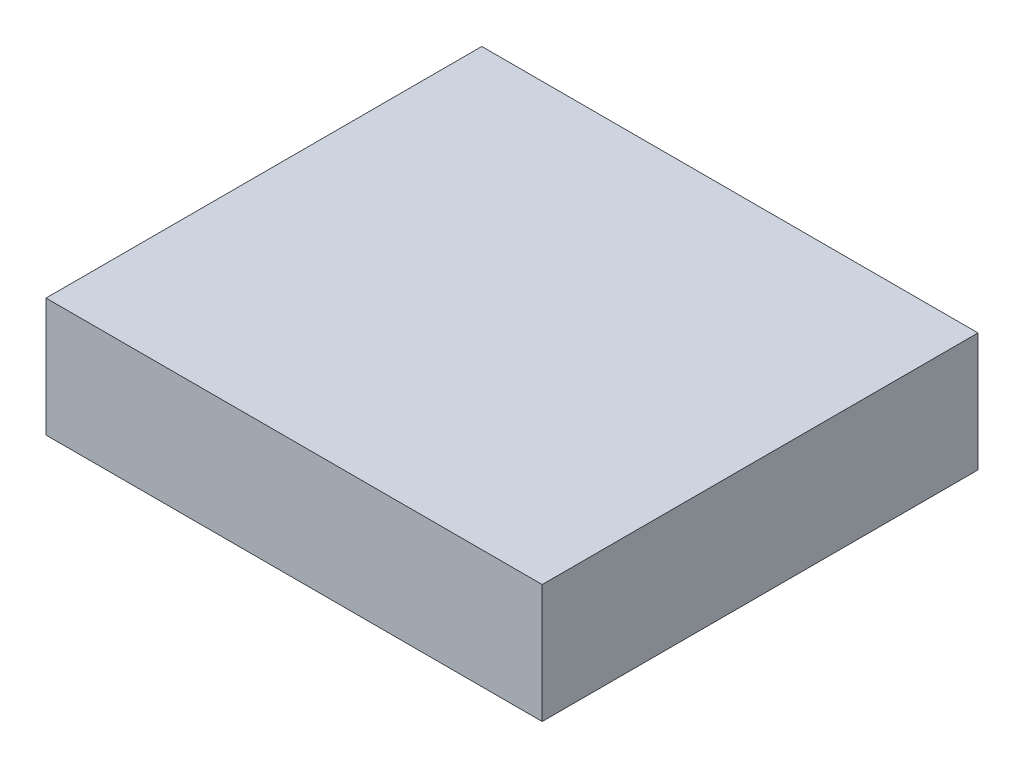
ISO-10303-21;
HEADER;
FILE_DESCRIPTION(('STEP AP214'),'2;1');
FILE_NAME('part.step','',(''),(''),'','','');
FILE_SCHEMA(('AUTOMOTIVE_DESIGN { 1 0 10303 214 1 1 1 1 }'));
ENDSEC;
DATA;
#1=APPLICATION_CONTEXT('core data for automotive mechanical design processes');
#2=APPLICATION_PROTOCOL_DEFINITION('international standard','automotive_design',2000,#1);
#3=PRODUCT_CONTEXT('',#1,'mechanical');
#4=PRODUCT('Part','Part','',(#3));
#5=PRODUCT_RELATED_PRODUCT_CATEGORY('part','',(#4));
#6=PRODUCT_DEFINITION_FORMATION('','',#4);
#7=PRODUCT_DEFINITION_CONTEXT('part definition',#1,'design');
#8=PRODUCT_DEFINITION('design','',#6,#7);
#9=PRODUCT_DEFINITION_SHAPE('','',#8);
#10=(LENGTH_UNIT() NAMED_UNIT(*) SI_UNIT(.MILLI.,.METRE.));
#11=(NAMED_UNIT(*) PLANE_ANGLE_UNIT() SI_UNIT($,.RADIAN.));
#12=(NAMED_UNIT(*) SI_UNIT($,.STERADIAN.) SOLID_ANGLE_UNIT());
#13=UNCERTAINTY_MEASURE_WITH_UNIT(LENGTH_MEASURE(1.E-05),#10,'distance_accuracy_value','');
#14=(GEOMETRIC_REPRESENTATION_CONTEXT(3) GLOBAL_UNCERTAINTY_ASSIGNED_CONTEXT((#13)) GLOBAL_UNIT_ASSIGNED_CONTEXT((#10,
#11,#12)) REPRESENTATION_CONTEXT('',''));
#15=CARTESIAN_POINT('',(0.,0.,0.));
#16=DIRECTION('',(0.,0.,1.));
#17=DIRECTION('',(1.,0.,0.));
#18=AXIS2_PLACEMENT_3D('',#15,#16,#17);
#19=CARTESIAN_POINT('',(57.5,27.5,50.5));
#20=DIRECTION('',(-1.,0.,0.));
#21=DIRECTION('',(0.,0.,1.));
#22=AXIS2_PLACEMENT_3D('',#19,#20,#21);
#23=PLANE('',#22);
#24=DIRECTION('',(0.,0.,-1.));
#25=VECTOR('',#24,1.);
#26=CARTESIAN_POINT('',(57.5,0.,50.5));
#27=LINE('',#26,#25);
#28=CARTESIAN_POINT('',(57.5,0.,50.5));
#29=VERTEX_POINT('',#28);
#30=CARTESIAN_POINT('',(57.5,0.,-50.5));
#31=VERTEX_POINT('',#30);
#32=EDGE_CURVE('E98',#29,#31,#27,.T.);
#33=ORIENTED_EDGE('',*,*,#32,.T.);
#34=DIRECTION('',(0.,-1.,0.));
#35=VECTOR('',#34,1.);
#36=CARTESIAN_POINT('',(57.5,27.5,-50.5));
#37=LINE('',#36,#35);
#38=CARTESIAN_POINT('',(57.5,27.5,-50.5));
#39=VERTEX_POINT('',#38);
#40=EDGE_CURVE('E11',#39,#31,#37,.T.);
#41=ORIENTED_EDGE('',*,*,#40,.F.);
#42=DIRECTION('',(0.,0.,-1.));
#43=VECTOR('',#42,1.);
#44=CARTESIAN_POINT('',(57.5,27.5,50.5));
#45=LINE('',#44,#43);
#46=CARTESIAN_POINT('',(57.5,27.5,50.5));
#47=VERTEX_POINT('',#46);
#48=EDGE_CURVE('E86',#47,#39,#45,.T.);
#49=ORIENTED_EDGE('',*,*,#48,.F.);
#50=DIRECTION('',(0.,-1.,0.));
#51=VECTOR('',#50,1.);
#52=CARTESIAN_POINT('',(57.5,27.5,50.5));
#53=LINE('',#52,#51);
#54=EDGE_CURVE('E94',#47,#29,#53,.T.);
#55=ORIENTED_EDGE('',*,*,#54,.T.);
#56=EDGE_LOOP('',(#33,#41,#49,#55));
#57=FACE_BOUND('',#56,.T.);
#58=ADVANCED_FACE('F35',(#57),#23,.F.);
#59=CARTESIAN_POINT('',(-57.5,27.5,-50.5));
#60=DIRECTION('',(0.,0.,1.));
#61=DIRECTION('',(1.,0.,0.));
#62=AXIS2_PLACEMENT_3D('',#59,#60,#61);
#63=PLANE('',#62);
#64=DIRECTION('',(-1.,0.,0.));
#65=VECTOR('',#64,1.);
#66=CARTESIAN_POINT('',(-57.5,0.,-50.5));
#67=LINE('',#66,#65);
#68=CARTESIAN_POINT('',(-57.5,0.,-50.5));
#69=VERTEX_POINT('',#68);
#70=EDGE_CURVE('E90',#31,#69,#67,.T.);
#71=ORIENTED_EDGE('',*,*,#70,.T.);
#72=DIRECTION('',(0.,-1.,0.));
#73=VECTOR('',#72,1.);
#74=CARTESIAN_POINT('',(-57.5,27.5,-50.5));
#75=LINE('',#74,#73);
#76=CARTESIAN_POINT('',(-57.5,27.5,-50.5));
#77=VERTEX_POINT('',#76);
#78=EDGE_CURVE('E43',#77,#69,#75,.T.);
#79=ORIENTED_EDGE('',*,*,#78,.F.);
#80=DIRECTION('',(-1.,0.,0.));
#81=VECTOR('',#80,1.);
#82=CARTESIAN_POINT('',(-57.5,27.5,-50.5));
#83=LINE('',#82,#81);
#84=EDGE_CURVE('E81',#39,#77,#83,.T.);
#85=ORIENTED_EDGE('',*,*,#84,.F.);
#86=ORIENTED_EDGE('',*,*,#40,.T.);
#87=EDGE_LOOP('',(#71,#79,#85,#86));
#88=FACE_BOUND('',#87,.T.);
#89=ADVANCED_FACE('F89',(#88),#63,.F.);
#90=CARTESIAN_POINT('',(-57.5,27.5,50.5));
#91=DIRECTION('',(1.,0.,0.));
#92=DIRECTION('',(0.,0.,-1.));
#93=AXIS2_PLACEMENT_3D('',#90,#91,#92);
#94=PLANE('',#93);
#95=DIRECTION('',(0.,0.,1.));
#96=VECTOR('',#95,1.);
#97=CARTESIAN_POINT('',(-57.5,0.,50.5));
#98=LINE('',#97,#96);
#99=CARTESIAN_POINT('',(-57.5,0.,50.5));
#100=VERTEX_POINT('',#99);
#101=EDGE_CURVE('E68',#69,#100,#98,.T.);
#102=ORIENTED_EDGE('',*,*,#101,.T.);
#103=DIRECTION('',(0.,-1.,0.));
#104=VECTOR('',#103,1.);
#105=CARTESIAN_POINT('',(-57.5,27.5,50.5));
#106=LINE('',#105,#104);
#107=CARTESIAN_POINT('',(-57.5,27.5,50.5));
#108=VERTEX_POINT('',#107);
#109=EDGE_CURVE('E91',#108,#100,#106,.T.);
#110=ORIENTED_EDGE('',*,*,#109,.F.);
#111=DIRECTION('',(0.,0.,1.));
#112=VECTOR('',#111,1.);
#113=CARTESIAN_POINT('',(-57.5,27.5,50.5));
#114=LINE('',#113,#112);
#115=EDGE_CURVE('E84',#77,#108,#114,.T.);
#116=ORIENTED_EDGE('',*,*,#115,.F.);
#117=ORIENTED_EDGE('',*,*,#78,.T.);
#118=EDGE_LOOP('',(#102,#110,#116,#117));
#119=FACE_BOUND('',#118,.T.);
#120=ADVANCED_FACE('F92',(#119),#94,.F.);
#121=CARTESIAN_POINT('',(-57.5,27.5,50.5));
#122=DIRECTION('',(0.,0.,-1.));
#123=DIRECTION('',(-1.,0.,0.));
#124=AXIS2_PLACEMENT_3D('',#121,#122,#123);
#125=PLANE('',#124);
#126=DIRECTION('',(1.,0.,0.));
#127=VECTOR('',#126,1.);
#128=CARTESIAN_POINT('',(-57.5,0.,50.5));
#129=LINE('',#128,#127);
#130=EDGE_CURVE('E74',#100,#29,#129,.T.);
#131=ORIENTED_EDGE('',*,*,#130,.T.);
#132=ORIENTED_EDGE('',*,*,#54,.F.);
#133=DIRECTION('',(1.,0.,0.));
#134=VECTOR('',#133,1.);
#135=CARTESIAN_POINT('',(-57.5,27.5,50.5));
#136=LINE('',#135,#134);
#137=EDGE_CURVE('E51',#108,#47,#136,.T.);
#138=ORIENTED_EDGE('',*,*,#137,.F.);
#139=ORIENTED_EDGE('',*,*,#109,.T.);
#140=EDGE_LOOP('',(#131,#132,#138,#139));
#141=FACE_BOUND('',#140,.T.);
#142=ADVANCED_FACE('F105',(#141),#125,.F.);
#143=CARTESIAN_POINT('',(0.,27.5,0.));
#144=DIRECTION('',(0.,-1.,0.));
#145=DIRECTION('',(0.,0.,-1.));
#146=AXIS2_PLACEMENT_3D('',#143,#144,#145);
#147=PLANE('',#146);
#148=ORIENTED_EDGE('',*,*,#48,.T.);
#149=ORIENTED_EDGE('',*,*,#84,.T.);
#150=ORIENTED_EDGE('',*,*,#115,.T.);
#151=ORIENTED_EDGE('',*,*,#137,.T.);
#152=EDGE_LOOP('',(#148,#149,#150,#151));
#153=FACE_BOUND('',#152,.T.);
#154=ADVANCED_FACE('F82',(#153),#147,.F.);
#155=CARTESIAN_POINT('',(0.,0.,0.));
#156=DIRECTION('',(0.,-1.,0.));
#157=DIRECTION('',(0.,0.,-1.));
#158=AXIS2_PLACEMENT_3D('',#155,#156,#157);
#159=PLANE('',#158);
#160=ORIENTED_EDGE('',*,*,#32,.F.);
#161=ORIENTED_EDGE('',*,*,#130,.F.);
#162=ORIENTED_EDGE('',*,*,#101,.F.);
#163=ORIENTED_EDGE('',*,*,#70,.F.);
#164=EDGE_LOOP('',(#160,#161,#162,#163));
#165=FACE_BOUND('',#164,.T.);
#166=ADVANCED_FACE('F108',(#165),#159,.T.);
#167=CLOSED_SHELL('',(#58,#89,#120,#142,#154,#166));
#168=MANIFOLD_SOLID_BREP('B2',#167);
#169=ADVANCED_BREP_SHAPE_REPRESENTATION('',(#18,#168),#14);
#170=SHAPE_DEFINITION_REPRESENTATION(#9,#169);
ENDSEC;
END-ISO-10303-21;
